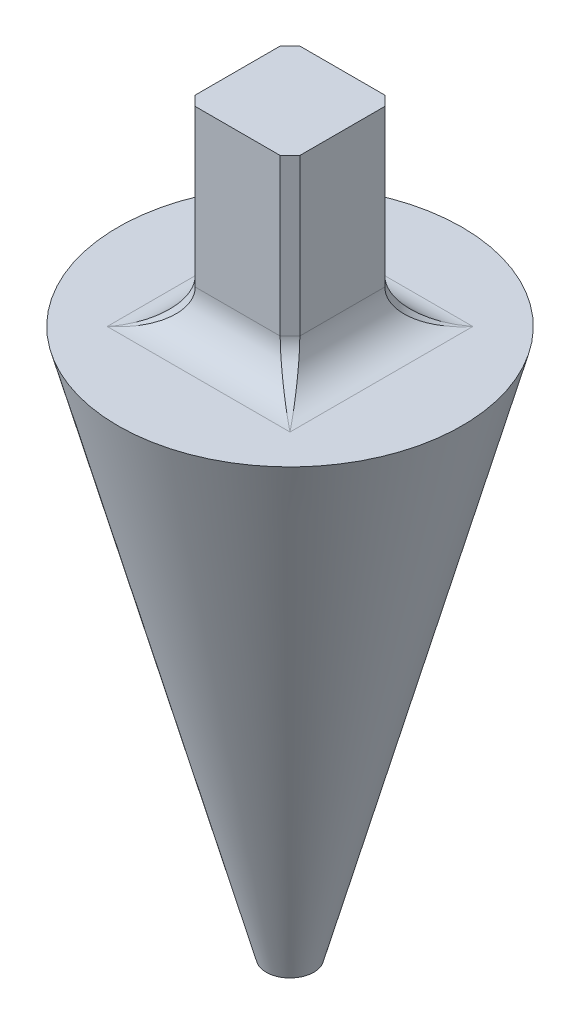
ISO-10303-21;
HEADER;
FILE_DESCRIPTION(('STEP AP214'),'2;1');
FILE_NAME('part.step','',(''),(''),'','','');
FILE_SCHEMA(('AUTOMOTIVE_DESIGN { 1 0 10303 214 1 1 1 1 }'));
ENDSEC;
DATA;
#1=APPLICATION_CONTEXT('core data for automotive mechanical design processes');
#2=APPLICATION_PROTOCOL_DEFINITION('international standard','automotive_design',2000,#1);
#3=PRODUCT_CONTEXT('',#1,'mechanical');
#4=PRODUCT('Part','Part','',(#3));
#5=PRODUCT_RELATED_PRODUCT_CATEGORY('part','',(#4));
#6=PRODUCT_DEFINITION_FORMATION('','',#4);
#7=PRODUCT_DEFINITION_CONTEXT('part definition',#1,'design');
#8=PRODUCT_DEFINITION('design','',#6,#7);
#9=PRODUCT_DEFINITION_SHAPE('','',#8);
#10=(LENGTH_UNIT() NAMED_UNIT(*) SI_UNIT(.MILLI.,.METRE.));
#11=(NAMED_UNIT(*) PLANE_ANGLE_UNIT() SI_UNIT($,.RADIAN.));
#12=(NAMED_UNIT(*) SI_UNIT($,.STERADIAN.) SOLID_ANGLE_UNIT());
#13=UNCERTAINTY_MEASURE_WITH_UNIT(LENGTH_MEASURE(1.E-05),#10,'distance_accuracy_value','');
#14=(GEOMETRIC_REPRESENTATION_CONTEXT(3) GLOBAL_UNCERTAINTY_ASSIGNED_CONTEXT((#13)) GLOBAL_UNIT_ASSIGNED_CONTEXT((#10,
#11,#12)) REPRESENTATION_CONTEXT('',''));
#15=CARTESIAN_POINT('',(0.,0.,0.));
#16=DIRECTION('',(0.,0.,1.));
#17=DIRECTION('',(1.,0.,0.));
#18=AXIS2_PLACEMENT_3D('',#15,#16,#17);
#19=CARTESIAN_POINT('',(0.,0.,-11.176));
#20=DIRECTION('',(0.,-1.,0.));
#21=DIRECTION('',(0.,0.,-1.));
#22=AXIS2_PLACEMENT_3D('',#19,#20,#21);
#23=PLANE('',#22);
#24=DIRECTION('',(-1.,0.,0.));
#25=VECTOR('',#24,1.);
#26=CARTESIAN_POINT('',(3.39725,0.,-5.93725));
#27=LINE('',#26,#25);
#28=CARTESIAN_POINT('',(-5.93725,0.,-5.93725));
#29=VERTEX_POINT('',#28);
#30=CARTESIAN_POINT('',(5.93725,0.,-5.93725));
#31=VERTEX_POINT('',#30);
#32=EDGE_CURVE('E151',#29,#31,#27,.F.);
#33=ORIENTED_EDGE('',*,*,#32,.T.);
#34=DIRECTION('',(0.,0.,-1.));
#35=VECTOR('',#34,1.);
#36=CARTESIAN_POINT('',(5.93725,0.,3.39725));
#37=LINE('',#36,#35);
#38=CARTESIAN_POINT('',(5.93725,0.,5.93725));
#39=VERTEX_POINT('',#38);
#40=EDGE_CURVE('E150',#31,#39,#37,.F.);
#41=ORIENTED_EDGE('',*,*,#40,.T.);
#42=DIRECTION('',(1.,0.,0.));
#43=VECTOR('',#42,1.);
#44=CARTESIAN_POINT('',(-3.39725,0.,5.93725));
#45=LINE('',#44,#43);
#46=CARTESIAN_POINT('',(-5.93725,0.,5.93725));
#47=VERTEX_POINT('',#46);
#48=EDGE_CURVE('E137',#39,#47,#45,.F.);
#49=ORIENTED_EDGE('',*,*,#48,.T.);
#50=DIRECTION('',(0.,0.,1.));
#51=VECTOR('',#50,1.);
#52=CARTESIAN_POINT('',(-5.93725,0.,-3.39725));
#53=LINE('',#52,#51);
#54=EDGE_CURVE('E147',#47,#29,#53,.F.);
#55=ORIENTED_EDGE('',*,*,#54,.T.);
#56=EDGE_LOOP('',(#33,#41,#49,#55));
#57=FACE_BOUND('',#56,.T.);
#58=CARTESIAN_POINT('',(0.,0.,0.));
#59=DIRECTION('',(0.,1.,0.));
#60=DIRECTION('',(0.,0.,1.));
#61=AXIS2_PLACEMENT_3D('',#58,#59,#60);
#62=CIRCLE('',#61,11.176);
#63=CARTESIAN_POINT('',(0.,0.,11.176));
#64=VERTEX_POINT('',#63);
#65=EDGE_CURVE('E159',#64,#64,#62,.T.);
#66=ORIENTED_EDGE('',*,*,#65,.T.);
#67=EDGE_LOOP('',(#66));
#68=FACE_BOUND('',#67,.T.);
#69=ADVANCED_FACE('F36',(#57,#68),#23,.F.);
#70=CARTESIAN_POINT('',(0.,-41.275,0.));
#71=DIRECTION('',(0.,1.,0.));
#72=DIRECTION('',(0.,0.,1.));
#73=AXIS2_PLACEMENT_3D('',#70,#71,#72);
#74=CONICAL_SURFACE('',#73,0.,0.264428659663494);
#75=CARTESIAN_POINT('',(0.,-35.56,0.));
#76=DIRECTION('',(0.,1.,0.));
#77=DIRECTION('',(0.,0.,1.));
#78=AXIS2_PLACEMENT_3D('',#75,#76,#77);
#79=CIRCLE('',#78,1.54744615384616);
#80=CARTESIAN_POINT('',(0.,-35.56,1.54744615384615));
#81=VERTEX_POINT('',#80);
#82=EDGE_CURVE('E429',#81,#81,#79,.T.);
#83=CARTESIAN_POINT('',(0.,-35.56,1.54744615384615));
#84=CARTESIAN_POINT('',(0.,-35.1895833333333,1.64774358974359));
#85=CARTESIAN_POINT('',(0.,-34.8191666666667,1.74804102564102));
#86=CARTESIAN_POINT('',(0.,-34.0783333333333,1.94863589743589));
#87=CARTESIAN_POINT('',(0.,-33.7079166666667,2.04893333333333));
#88=CARTESIAN_POINT('',(0.,-32.9670833333333,2.2495282051282));
#89=CARTESIAN_POINT('',(0.,-32.5966666666667,2.34982564102564));
#90=CARTESIAN_POINT('',(0.,-31.8558333333333,2.55042051282051));
#91=CARTESIAN_POINT('',(0.,-31.4854166666667,2.65071794871794));
#92=CARTESIAN_POINT('',(0.,-30.7445833333333,2.85131282051282));
#93=CARTESIAN_POINT('',(0.,-30.3741666666667,2.95161025641025));
#94=CARTESIAN_POINT('',(0.,-29.6333333333333,3.15220512820512));
#95=CARTESIAN_POINT('',(0.,-29.2629166666667,3.25250256410256));
#96=CARTESIAN_POINT('',(0.,-28.5220833333333,3.45309743589743));
#97=CARTESIAN_POINT('',(0.,-28.1516666666667,3.55339487179487));
#98=CARTESIAN_POINT('',(0.,-27.4108333333333,3.75398974358974));
#99=CARTESIAN_POINT('',(0.,-27.0404166666667,3.85428717948718));
#100=CARTESIAN_POINT('',(0.,-26.2995833333333,4.05488205128205));
#101=CARTESIAN_POINT('',(0.,-25.9291666666667,4.15517948717948));
#102=CARTESIAN_POINT('',(0.,-25.1883333333333,4.35577435897436));
#103=CARTESIAN_POINT('',(0.,-24.8179166666667,4.45607179487179));
#104=CARTESIAN_POINT('',(0.,-24.0770833333333,4.65666666666666));
#105=CARTESIAN_POINT('',(0.,-23.7066666666667,4.7569641025641));
#106=CARTESIAN_POINT('',(0.,-22.9658333333333,4.95755897435897));
#107=CARTESIAN_POINT('',(0.,-22.5954166666667,5.05785641025641));
#108=CARTESIAN_POINT('',(0.,-21.8545833333333,5.25845128205128));
#109=CARTESIAN_POINT('',(0.,-21.4841666666667,5.35874871794871));
#110=CARTESIAN_POINT('',(0.,-20.7433333333333,5.55934358974359));
#111=CARTESIAN_POINT('',(0.,-20.3729166666667,5.65964102564102));
#112=CARTESIAN_POINT('',(0.,-19.6320833333333,5.86023589743589));
#113=CARTESIAN_POINT('',(0.,-19.2616666666667,5.96053333333333));
#114=CARTESIAN_POINT('',(0.,-18.5208333333333,6.1611282051282));
#115=CARTESIAN_POINT('',(0.,-18.1504166666667,6.26142564102564));
#116=CARTESIAN_POINT('',(0.,-17.4095833333333,6.46202051282051));
#117=CARTESIAN_POINT('',(0.,-17.0391666666667,6.56231794871795));
#118=CARTESIAN_POINT('',(0.,-16.2983333333333,6.76291282051282));
#119=CARTESIAN_POINT('',(0.,-15.9279166666667,6.86321025641025));
#120=CARTESIAN_POINT('',(0.,-15.1870833333333,7.06380512820513));
#121=CARTESIAN_POINT('',(0.,-14.8166666666667,7.16410256410256));
#122=CARTESIAN_POINT('',(0.,-14.0758333333333,7.36469743589743));
#123=CARTESIAN_POINT('',(0.,-13.7054166666667,7.46499487179487));
#124=CARTESIAN_POINT('',(0.,-12.9645833333333,7.66558974358974));
#125=CARTESIAN_POINT('',(0.,-12.5941666666667,7.76588717948718));
#126=CARTESIAN_POINT('',(0.,-11.8533333333333,7.96648205128205));
#127=CARTESIAN_POINT('',(0.,-11.4829166666667,8.06677948717949));
#128=CARTESIAN_POINT('',(0.,-10.7420833333333,8.26737435897436));
#129=CARTESIAN_POINT('',(0.,-10.3716666666667,8.36767179487179));
#130=CARTESIAN_POINT('',(0.,-9.63083333333334,8.56826666666666));
#131=CARTESIAN_POINT('',(0.,-9.26041666666667,8.6685641025641));
#132=CARTESIAN_POINT('',(0.,-8.51958333333334,8.86915897435897));
#133=CARTESIAN_POINT('',(0.,-8.14916666666667,8.96945641025641));
#134=CARTESIAN_POINT('',(0.,-7.40833333333333,9.17005128205128));
#135=CARTESIAN_POINT('',(0.,-7.03791666666667,9.27034871794872));
#136=CARTESIAN_POINT('',(0.,-6.29708333333333,9.47094358974359));
#137=CARTESIAN_POINT('',(0.,-5.92666666666667,9.57124102564102));
#138=CARTESIAN_POINT('',(0.,-5.18583333333334,9.7718358974359));
#139=CARTESIAN_POINT('',(0.,-4.81541666666667,9.87213333333333));
#140=CARTESIAN_POINT('',(0.,-4.07458333333333,10.0727282051282));
#141=CARTESIAN_POINT('',(0.,-3.70416666666667,10.1730256410256));
#142=CARTESIAN_POINT('',(0.,-2.96333333333334,10.3736205128205));
#143=CARTESIAN_POINT('',(0.,-2.59291666666667,10.4739179487179));
#144=CARTESIAN_POINT('',(0.,-1.85208333333334,10.6745128205128));
#145=CARTESIAN_POINT('',(0.,-1.48166666666667,10.7748102564103));
#146=CARTESIAN_POINT('',(0.,-0.740833333333336,10.9754051282051));
#147=CARTESIAN_POINT('',(0.,-0.370416666666671,11.0757025641026));
#148=CARTESIAN_POINT('',(0.,0.,11.176));
#149=B_SPLINE_CURVE_WITH_KNOTS('',3,(#83,#84,#85,#86,#87,#88,#89,#90,#91,#92,#93,#94,#95,#96,
#97,#98,#99,#100,#101,#102,#103,#104,#105,#106,#107,#108,#109,#110,#111,#112,#113,#114,#115,
#116,#117,#118,#119,#120,#121,#122,#123,#124,#125,#126,#127,#128,#129,#130,#131,#132,#133,#134,
#135,#136,#137,#138,#139,#140,#141,#142,#143,#144,#145,#146,#147,#148),.UNSPECIFIED.,.F.,.F.,(4,
2,2,2,2,2,2,2,2,2,2,2,2,2,2,2,2,2,2,2,2,2,2,2,2,2,2,2,2,2,2,2,4),(0.,1.15126571360759,
2.30253142721518,3.45379714082278,4.60506285443037,5.75632856803796,6.90759428164556,
8.05885999525315,9.21012570886075,10.3613914224683,11.5126571360759,12.6639228496835,
13.8151885632911,14.9664542768987,16.1177199905063,17.2689857041139,18.4202514177215,
19.5715171313291,20.7227828449367,21.8740485585443,23.0253142721519,24.1765799857595,
25.3278456993671,26.4791114129747,27.6303771265822,28.7816428401898,29.9329085537974,
31.084174267405,32.2354399810126,33.3867056946202,34.5379714082278,35.6892371218354,
36.840502835443),.UNSPECIFIED.);
#150=EDGE_CURVE('BSEAM556',#81,#64,#149,.T.);
#151=ORIENTED_EDGE('',*,*,#82,.T.);
#152=ORIENTED_EDGE('',*,*,#65,.F.);
#153=ORIENTED_EDGE('',*,*,#150,.T.);
#154=ORIENTED_EDGE('',*,*,#150,.F.);
#155=EDGE_LOOP('',(#151,#153,#152,#154));
#156=FACE_BOUND('',#155,.T.);
#157=ADVANCED_FACE('F556',(#156),#74,.T.);
#158=CARTESIAN_POINT('',(3.39725,12.7,-3.39725));
#159=DIRECTION('',(-1.,0.,0.));
#160=DIRECTION('',(0.,0.,1.));
#161=AXIS2_PLACEMENT_3D('',#158,#159,#160);
#162=PLANE('',#161);
#163=DIRECTION('',(0.,0.,-1.));
#164=VECTOR('',#163,1.);
#165=CARTESIAN_POINT('',(3.39725,2.54,-3.39725));
#166=LINE('',#165,#164);
#167=CARTESIAN_POINT('',(3.39725,2.54,2.76225));
#168=VERTEX_POINT('',#167);
#169=CARTESIAN_POINT('',(3.39725,2.54,-2.76225));
#170=VERTEX_POINT('',#169);
#171=EDGE_CURVE('E156',#168,#170,#166,.T.);
#172=ORIENTED_EDGE('',*,*,#171,.T.);
#173=DIRECTION('',(0.,1.,0.));
#174=VECTOR('',#173,1.);
#175=CARTESIAN_POINT('',(3.39725,12.7,-2.76225));
#176=LINE('',#175,#174);
#177=CARTESIAN_POINT('',(3.39725,12.7,-2.76225));
#178=VERTEX_POINT('',#177);
#179=EDGE_CURVE('E492',#170,#178,#176,.T.);
#180=ORIENTED_EDGE('',*,*,#179,.T.);
#181=DIRECTION('',(0.,0.,-1.));
#182=VECTOR('',#181,1.);
#183=CARTESIAN_POINT('',(3.39725,12.7,-3.39725));
#184=LINE('',#183,#182);
#185=CARTESIAN_POINT('',(3.39725,12.7,2.76225));
#186=VERTEX_POINT('',#185);
#187=EDGE_CURVE('E431',#186,#178,#184,.T.);
#188=ORIENTED_EDGE('',*,*,#187,.F.);
#189=DIRECTION('',(0.,-1.,0.));
#190=VECTOR('',#189,1.);
#191=CARTESIAN_POINT('',(3.39725,12.7,2.76225));
#192=LINE('',#191,#190);
#193=EDGE_CURVE('E490',#186,#168,#192,.T.);
#194=ORIENTED_EDGE('',*,*,#193,.T.);
#195=EDGE_LOOP('',(#172,#180,#188,#194));
#196=FACE_BOUND('',#195,.T.);
#197=ADVANCED_FACE('F542',(#196),#162,.F.);
#198=CARTESIAN_POINT('',(-3.39725,12.7,-3.39725));
#199=DIRECTION('',(0.,0.,1.));
#200=DIRECTION('',(1.,0.,0.));
#201=AXIS2_PLACEMENT_3D('',#198,#199,#200);
#202=PLANE('',#201);
#203=DIRECTION('',(-1.,0.,0.));
#204=VECTOR('',#203,1.);
#205=CARTESIAN_POINT('',(-3.39725,12.7,-3.39725));
#206=LINE('',#205,#204);
#207=CARTESIAN_POINT('',(2.76225,12.7,-3.39725));
#208=VERTEX_POINT('',#207);
#209=CARTESIAN_POINT('',(-2.76225,12.7,-3.39725));
#210=VERTEX_POINT('',#209);
#211=EDGE_CURVE('E436',#208,#210,#206,.T.);
#212=ORIENTED_EDGE('',*,*,#211,.F.);
#213=DIRECTION('',(0.,-1.,0.));
#214=VECTOR('',#213,1.);
#215=CARTESIAN_POINT('',(2.76225,12.7,-3.39725));
#216=LINE('',#215,#214);
#217=CARTESIAN_POINT('',(2.76225,2.54,-3.39725));
#218=VERTEX_POINT('',#217);
#219=EDGE_CURVE('E487',#208,#218,#216,.T.);
#220=ORIENTED_EDGE('',*,*,#219,.T.);
#221=DIRECTION('',(-1.,0.,0.));
#222=VECTOR('',#221,1.);
#223=CARTESIAN_POINT('',(-3.39725,2.54,-3.39725));
#224=LINE('',#223,#222);
#225=CARTESIAN_POINT('',(-2.76225,2.54,-3.39725));
#226=VERTEX_POINT('',#225);
#227=EDGE_CURVE('E462',#218,#226,#224,.T.);
#228=ORIENTED_EDGE('',*,*,#227,.T.);
#229=DIRECTION('',(0.,1.,0.));
#230=VECTOR('',#229,1.);
#231=CARTESIAN_POINT('',(-2.76225,12.7,-3.39725));
#232=LINE('',#231,#230);
#233=EDGE_CURVE('E177',#226,#210,#232,.T.);
#234=ORIENTED_EDGE('',*,*,#233,.T.);
#235=EDGE_LOOP('',(#212,#220,#228,#234));
#236=FACE_BOUND('',#235,.T.);
#237=ADVANCED_FACE('F484',(#236),#202,.F.);
#238=CARTESIAN_POINT('',(-3.39725,12.7,-3.39725));
#239=DIRECTION('',(1.,0.,0.));
#240=DIRECTION('',(0.,0.,-1.));
#241=AXIS2_PLACEMENT_3D('',#238,#239,#240);
#242=PLANE('',#241);
#243=DIRECTION('',(0.,0.,1.));
#244=VECTOR('',#243,1.);
#245=CARTESIAN_POINT('',(-3.39725,12.7,-3.39725));
#246=LINE('',#245,#244);
#247=CARTESIAN_POINT('',(-3.39725,12.7,-2.76225));
#248=VERTEX_POINT('',#247);
#249=CARTESIAN_POINT('',(-3.39725,12.7,2.76225));
#250=VERTEX_POINT('',#249);
#251=EDGE_CURVE('E546',#248,#250,#246,.T.);
#252=ORIENTED_EDGE('',*,*,#251,.F.);
#253=DIRECTION('',(0.,-1.,0.));
#254=VECTOR('',#253,1.);
#255=CARTESIAN_POINT('',(-3.39725,12.7,-2.76225));
#256=LINE('',#255,#254);
#257=CARTESIAN_POINT('',(-3.39725,2.54,-2.76225));
#258=VERTEX_POINT('',#257);
#259=EDGE_CURVE('E140',#248,#258,#256,.T.);
#260=ORIENTED_EDGE('',*,*,#259,.T.);
#261=DIRECTION('',(0.,0.,1.));
#262=VECTOR('',#261,1.);
#263=CARTESIAN_POINT('',(-3.39725,2.54,3.39725));
#264=LINE('',#263,#262);
#265=CARTESIAN_POINT('',(-3.39725,2.54,2.76225));
#266=VERTEX_POINT('',#265);
#267=EDGE_CURVE('E510',#258,#266,#264,.T.);
#268=ORIENTED_EDGE('',*,*,#267,.T.);
#269=DIRECTION('',(0.,1.,0.));
#270=VECTOR('',#269,1.);
#271=CARTESIAN_POINT('',(-3.39725,12.7,2.76225));
#272=LINE('',#271,#270);
#273=EDGE_CURVE('E428',#266,#250,#272,.T.);
#274=ORIENTED_EDGE('',*,*,#273,.T.);
#275=EDGE_LOOP('',(#252,#260,#268,#274));
#276=FACE_BOUND('',#275,.T.);
#277=ADVANCED_FACE('F551',(#276),#242,.F.);
#278=CARTESIAN_POINT('',(-3.39725,12.7,3.39725));
#279=DIRECTION('',(0.,0.,-1.));
#280=DIRECTION('',(-1.,0.,0.));
#281=AXIS2_PLACEMENT_3D('',#278,#279,#280);
#282=PLANE('',#281);
#283=DIRECTION('',(1.,0.,0.));
#284=VECTOR('',#283,1.);
#285=CARTESIAN_POINT('',(3.39725,2.54,3.39725));
#286=LINE('',#285,#284);
#287=CARTESIAN_POINT('',(-2.76225,2.54,3.39725));
#288=VERTEX_POINT('',#287);
#289=CARTESIAN_POINT('',(2.76225,2.54,3.39725));
#290=VERTEX_POINT('',#289);
#291=EDGE_CURVE('E139',#288,#290,#286,.T.);
#292=ORIENTED_EDGE('',*,*,#291,.T.);
#293=DIRECTION('',(0.,1.,0.));
#294=VECTOR('',#293,1.);
#295=CARTESIAN_POINT('',(2.76225,12.7,3.39725));
#296=LINE('',#295,#294);
#297=CARTESIAN_POINT('',(2.76225,12.7,3.39725));
#298=VERTEX_POINT('',#297);
#299=EDGE_CURVE('E11',#290,#298,#296,.T.);
#300=ORIENTED_EDGE('',*,*,#299,.T.);
#301=DIRECTION('',(1.,0.,0.));
#302=VECTOR('',#301,1.);
#303=CARTESIAN_POINT('',(-3.39725,12.7,3.39725));
#304=LINE('',#303,#302);
#305=CARTESIAN_POINT('',(-2.76225,12.7,3.39725));
#306=VERTEX_POINT('',#305);
#307=EDGE_CURVE('E540',#306,#298,#304,.T.);
#308=ORIENTED_EDGE('',*,*,#307,.F.);
#309=DIRECTION('',(0.,-1.,0.));
#310=VECTOR('',#309,1.);
#311=CARTESIAN_POINT('',(-2.76225,12.7,3.39725));
#312=LINE('',#311,#310);
#313=EDGE_CURVE('E48',#306,#288,#312,.T.);
#314=ORIENTED_EDGE('',*,*,#313,.T.);
#315=EDGE_LOOP('',(#292,#300,#308,#314));
#316=FACE_BOUND('',#315,.T.);
#317=ADVANCED_FACE('F534',(#316),#282,.F.);
#318=CARTESIAN_POINT('',(0.,12.7,0.));
#319=DIRECTION('',(0.,1.,0.));
#320=DIRECTION('',(0.,0.,1.));
#321=AXIS2_PLACEMENT_3D('',#318,#319,#320);
#322=PLANE('',#321);
#323=ORIENTED_EDGE('',*,*,#187,.T.);
#324=DIRECTION('',(0.707106781186544,0.,0.707106781186551));
#325=VECTOR('',#324,1.);
#326=CARTESIAN_POINT('',(3.07975000000002,12.7,-3.07974999999998));
#327=LINE('',#326,#325);
#328=EDGE_CURVE('E132',#178,#208,#327,.F.);
#329=ORIENTED_EDGE('',*,*,#328,.T.);
#330=ORIENTED_EDGE('',*,*,#211,.T.);
#331=DIRECTION('',(0.707106781186548,0.,-0.707106781186548));
#332=VECTOR('',#331,1.);
#333=CARTESIAN_POINT('',(-3.07975,12.7,-3.07975));
#334=LINE('',#333,#332);
#335=EDGE_CURVE('E507',#210,#248,#334,.F.);
#336=ORIENTED_EDGE('',*,*,#335,.T.);
#337=ORIENTED_EDGE('',*,*,#251,.T.);
#338=DIRECTION('',(-0.707106781186548,0.,-0.707106781186548));
#339=VECTOR('',#338,1.);
#340=CARTESIAN_POINT('',(-3.07975,12.7,3.07975));
#341=LINE('',#340,#339);
#342=EDGE_CURVE('E501',#250,#306,#341,.F.);
#343=ORIENTED_EDGE('',*,*,#342,.T.);
#344=ORIENTED_EDGE('',*,*,#307,.T.);
#345=DIRECTION('',(-0.707106781186547,0.,0.707106781186548));
#346=VECTOR('',#345,1.);
#347=CARTESIAN_POINT('',(3.07975,12.7,3.07975));
#348=LINE('',#347,#346);
#349=EDGE_CURVE('E505',#298,#186,#348,.F.);
#350=ORIENTED_EDGE('',*,*,#349,.T.);
#351=EDGE_LOOP('',(#323,#329,#330,#336,#337,#343,#344,#350));
#352=FACE_BOUND('',#351,.T.);
#353=ADVANCED_FACE('F539',(#352),#322,.T.);
#354=CARTESIAN_POINT('',(0.,-35.56,0.));
#355=DIRECTION('',(0.,1.,0.));
#356=DIRECTION('',(0.,0.,1.));
#357=AXIS2_PLACEMENT_3D('',#354,#355,#356);
#358=PLANE('',#357);
#359=ORIENTED_EDGE('',*,*,#82,.F.);
#360=EDGE_LOOP('',(#359));
#361=FACE_BOUND('',#360,.T.);
#362=ADVANCED_FACE('F574',(#361),#358,.F.);
#363=CARTESIAN_POINT('',(-5.93725,2.54,-3.39725));
#364=DIRECTION('',(0.,0.,-1.));
#365=DIRECTION('',(0.,1.,0.));
#366=AXIS2_PLACEMENT_3D('',#363,#364,#365);
#367=CYLINDRICAL_SURFACE('',#366,2.54);
#368=ORIENTED_EDGE('',*,*,#267,.F.);
#369=CARTESIAN_POINT('',(-5.93725,0.,-5.93725));
#370=CARTESIAN_POINT('',(-5.77100645958709,-1.12002942960682E-05,-5.72944557448386));
#371=CARTESIAN_POINT('',(-5.60476979962949,0.0163728819134338,-5.52164974953686));
#372=CARTESIAN_POINT('',(-5.27867136452858,0.0812378936381565,-5.11402670566073));
#373=CARTESIAN_POINT('',(-5.11882308635639,0.129727338699658,-4.91421635794548));
#374=CARTESIAN_POINT('',(-4.81164507722896,0.256964636143005,-4.5302438465362));
#375=CARTESIAN_POINT('',(-4.66432806041091,0.335707222142205,-4.34609757551363));
#376=CARTESIAN_POINT('',(-4.38787515584951,0.520427147360865,-4.0005314448119));
#377=CARTESIAN_POINT('',(-4.25875071075607,0.626396840816273,-3.83912588844508));
#378=CARTESIAN_POINT('',(-4.02364684081627,0.861500710756064,-3.54524605102034));
#379=CARTESIAN_POINT('',(-3.91767714748121,0.990625155669409,-3.41278393435151));
#380=CARTESIAN_POINT('',(-3.73295722202186,1.26707806059101,-3.18188402752732));
#381=CARTESIAN_POINT('',(-3.65421463632009,1.41439507680143,-3.08345579540011));
#382=CARTESIAN_POINT('',(-3.52697733852257,1.72157308678391,-2.92440917315321));
#383=CARTESIAN_POINT('',(-3.47848789377609,1.88142136383515,-2.86379736722011));
#384=CARTESIAN_POINT('',(-3.4136228817755,2.20751980032292,-2.78271610221937));
#385=CARTESIAN_POINT('',(-3.3972387997057,2.37375645958709,-2.76223599963213));
#386=CARTESIAN_POINT('',(-3.39725,2.54,-2.76225));
#387=B_SPLINE_CURVE_WITH_KNOTS('',3,(#369,#370,#371,#372,#373,#374,#375,#376,#377,#378,#379,
#380,#381,#382,#383,#384,#385,#386),.UNSPECIFIED.,.F.,.F.,(4,2,2,2,2,2,2,2,4),(0.,
0.196349540849362,0.392699081698724,0.589048622548086,0.785398163397448,0.98174770424681,
1.17809724509617,1.37444678594553,1.5707963267949),.UNSPECIFIED.);
#388=EDGE_CURVE('E131',#258,#29,#387,.F.);
#389=ORIENTED_EDGE('',*,*,#388,.T.);
#390=ORIENTED_EDGE('',*,*,#54,.F.);
#391=CARTESIAN_POINT('',(-3.39725,2.54,2.76225));
#392=CARTESIAN_POINT('',(-3.3972387997057,2.37375645958709,2.76223599963213));
#393=CARTESIAN_POINT('',(-3.4136228817755,2.20751980032292,2.78271610221938));
#394=CARTESIAN_POINT('',(-3.47848789377609,1.88142136383515,2.86379736722011));
#395=CARTESIAN_POINT('',(-3.52697733852257,1.72157308678392,2.92440917315321));
#396=CARTESIAN_POINT('',(-3.65421463632009,1.41439507680143,3.08345579540012));
#397=CARTESIAN_POINT('',(-3.73295722202186,1.26707806059101,3.18188402752733));
#398=CARTESIAN_POINT('',(-3.91767714748121,0.990625155669407,3.41278393435151));
#399=CARTESIAN_POINT('',(-4.02364684081627,0.861500710756065,3.54524605102034));
#400=CARTESIAN_POINT('',(-4.25875071075607,0.626396840816269,3.83912588844509));
#401=CARTESIAN_POINT('',(-4.38787515584952,0.520427147360866,4.0005314448119));
#402=CARTESIAN_POINT('',(-4.6643280604109,0.335707222142203,4.34609757551363));
#403=CARTESIAN_POINT('',(-4.81164507722895,0.256964636143005,4.5302438465362));
#404=CARTESIAN_POINT('',(-5.11882308635638,0.129727338699658,4.91421635794548));
#405=CARTESIAN_POINT('',(-5.27867136452858,0.081237893638155,5.11402670566072));
#406=CARTESIAN_POINT('',(-5.60476979962949,0.0163728819134319,5.52164974953686));
#407=CARTESIAN_POINT('',(-5.77100645958708,-1.12002942978607E-05,5.72944557448384));
#408=CARTESIAN_POINT('',(-5.93725,0.,5.93725));
#409=B_SPLINE_CURVE_WITH_KNOTS('',3,(#391,#392,#393,#394,#395,#396,#397,#398,#399,#400,#401,
#402,#403,#404,#405,#406,#407,#408),.UNSPECIFIED.,.F.,.F.,(4,2,2,2,2,2,2,2,4),(3.14159265358979,
3.33794219443916,3.53429173528852,3.73064127613788,3.92699081698724,4.1233403578366,
4.31968989868597,4.51603943953533,4.71238898038469),.UNSPECIFIED.);
#410=EDGE_CURVE('E118',#47,#266,#409,.F.);
#411=ORIENTED_EDGE('',*,*,#410,.T.);
#412=EDGE_LOOP('',(#368,#389,#390,#411));
#413=FACE_BOUND('',#412,.T.);
#414=ADVANCED_FACE('F153',(#413),#367,.F.);
#415=CARTESIAN_POINT('',(-3.39725,2.54,5.93725));
#416=DIRECTION('',(-1.,0.,0.));
#417=DIRECTION('',(0.,0.,1.));
#418=AXIS2_PLACEMENT_3D('',#415,#416,#417);
#419=CYLINDRICAL_SURFACE('',#418,2.54);
#420=ORIENTED_EDGE('',*,*,#48,.F.);
#421=CARTESIAN_POINT('',(2.76225,2.54,3.39725));
#422=CARTESIAN_POINT('',(2.76223599963213,2.37375645958709,3.3972387997057));
#423=CARTESIAN_POINT('',(2.78271610221938,2.20751980032292,3.4136228817755));
#424=CARTESIAN_POINT('',(2.86379736722011,1.88142136383515,3.47848789377609));
#425=CARTESIAN_POINT('',(2.92440917315321,1.72157308678392,3.52697733852257));
#426=CARTESIAN_POINT('',(3.08345579540012,1.41439507680143,3.65421463632009));
#427=CARTESIAN_POINT('',(3.18188402752733,1.26707806059101,3.73295722202186));
#428=CARTESIAN_POINT('',(3.41278393435152,0.990625155669408,3.91767714748121));
#429=CARTESIAN_POINT('',(3.54524605102034,0.861500710756065,4.02364684081627));
#430=CARTESIAN_POINT('',(3.83912588844509,0.626396840816271,4.25875071075607));
#431=CARTESIAN_POINT('',(4.0005314448119,0.520427147360868,4.38787515584951));
#432=CARTESIAN_POINT('',(4.34609757551363,0.335707222142204,4.6643280604109));
#433=CARTESIAN_POINT('',(4.53024384653619,0.256964636143006,4.81164507722895));
#434=CARTESIAN_POINT('',(4.91421635794548,0.129727338699659,5.11882308635638));
#435=CARTESIAN_POINT('',(5.11402670566072,0.0812378936381561,5.27867136452857));
#436=CARTESIAN_POINT('',(5.52164974953686,0.0163728819134316,5.60476979962949));
#437=CARTESIAN_POINT('',(5.72944557448384,-1.12002942972523E-05,5.77100645958707));
#438=CARTESIAN_POINT('',(5.93725000000001,0.,5.93725));
#439=B_SPLINE_CURVE_WITH_KNOTS('',3,(#421,#422,#423,#424,#425,#426,#427,#428,#429,#430,#431,
#432,#433,#434,#435,#436,#437,#438),.UNSPECIFIED.,.F.,.F.,(4,2,2,2,2,2,2,2,4),(3.14159265358979,
3.33794219443916,3.53429173528852,3.73064127613788,3.92699081698724,4.1233403578366,
4.31968989868597,4.51603943953533,4.71238898038469),.UNSPECIFIED.);
#440=EDGE_CURVE('E56',#39,#290,#439,.F.);
#441=ORIENTED_EDGE('',*,*,#440,.T.);
#442=ORIENTED_EDGE('',*,*,#291,.F.);
#443=CARTESIAN_POINT('',(-5.93725000000001,0.,5.93725));
#444=CARTESIAN_POINT('',(-5.72944557448384,-1.12002942976456E-05,5.77100645958707));
#445=CARTESIAN_POINT('',(-5.52164974953686,0.0163728819134316,5.60476979962949));
#446=CARTESIAN_POINT('',(-5.11402670566072,0.0812378936381553,5.27867136452857));
#447=CARTESIAN_POINT('',(-4.91421635794548,0.129727338699658,5.11882308635638));
#448=CARTESIAN_POINT('',(-4.53024384653619,0.256964636143006,4.81164507722895));
#449=CARTESIAN_POINT('',(-4.34609757551363,0.335707222142203,4.6643280604109));
#450=CARTESIAN_POINT('',(-4.0005314448119,0.520427147360868,4.38787515584951));
#451=CARTESIAN_POINT('',(-3.83912588844509,0.62639684081627,4.25875071075607));
#452=CARTESIAN_POINT('',(-3.54524605102034,0.861500710756065,4.02364684081627));
#453=CARTESIAN_POINT('',(-3.41278393435152,0.990625155669408,3.91767714748121));
#454=CARTESIAN_POINT('',(-3.18188402752733,1.26707806059101,3.73295722202186));
#455=CARTESIAN_POINT('',(-3.08345579540012,1.41439507680143,3.65421463632009));
#456=CARTESIAN_POINT('',(-2.92440917315321,1.72157308678392,3.52697733852257));
#457=CARTESIAN_POINT('',(-2.86379736722011,1.88142136383515,3.47848789377609));
#458=CARTESIAN_POINT('',(-2.78271610221938,2.20751980032292,3.4136228817755));
#459=CARTESIAN_POINT('',(-2.76223599963213,2.37375645958709,3.3972387997057));
#460=CARTESIAN_POINT('',(-2.76225,2.54,3.39725));
#461=B_SPLINE_CURVE_WITH_KNOTS('',3,(#443,#444,#445,#446,#447,#448,#449,#450,#451,#452,#453,
#454,#455,#456,#457,#458,#459,#460),.UNSPECIFIED.,.F.,.F.,(4,2,2,2,2,2,2,2,4),(3.14159265358979,
3.33794219443916,3.53429173528852,3.73064127613788,3.92699081698724,4.1233403578366,
4.31968989868597,4.51603943953533,4.71238898038469),.UNSPECIFIED.);
#462=EDGE_CURVE('E121',#288,#47,#461,.F.);
#463=ORIENTED_EDGE('',*,*,#462,.T.);
#464=EDGE_LOOP('',(#420,#441,#442,#463));
#465=FACE_BOUND('',#464,.T.);
#466=ADVANCED_FACE('F136',(#465),#419,.F.);
#467=CARTESIAN_POINT('',(-3.39725,2.54,-5.93725));
#468=DIRECTION('',(1.,0.,0.));
#469=DIRECTION('',(0.,0.,-1.));
#470=AXIS2_PLACEMENT_3D('',#467,#468,#469);
#471=CYLINDRICAL_SURFACE('',#470,2.54);
#472=ORIENTED_EDGE('',*,*,#227,.F.);
#473=CARTESIAN_POINT('',(5.93725,0.,-5.93725));
#474=CARTESIAN_POINT('',(5.72944557448386,-1.12002942921013E-05,-5.77100645958709));
#475=CARTESIAN_POINT('',(5.52164974953686,0.0163728819134374,-5.60476979962949));
#476=CARTESIAN_POINT('',(5.11402670566073,0.0812378936381605,-5.27867136452858));
#477=CARTESIAN_POINT('',(4.91421635794548,0.129727338699662,-5.11882308635639));
#478=CARTESIAN_POINT('',(4.5302438465362,0.256964636143008,-4.81164507722896));
#479=CARTESIAN_POINT('',(4.34609757551363,0.335707222142209,-4.6643280604109));
#480=CARTESIAN_POINT('',(4.0005314448119,0.520427147360867,-4.38787515584952));
#481=CARTESIAN_POINT('',(3.83912588844508,0.626396840816278,-4.25875071075607));
#482=CARTESIAN_POINT('',(3.54524605102034,0.861500710756066,-4.02364684081628));
#483=CARTESIAN_POINT('',(3.41278393435151,0.990625155669413,-3.91767714748121));
#484=CARTESIAN_POINT('',(3.18188402752733,1.26707806059101,-3.73295722202187));
#485=CARTESIAN_POINT('',(3.08345579540011,1.41439507680143,-3.65421463632009));
#486=CARTESIAN_POINT('',(2.92440917315321,1.72157308678391,-3.52697733852258));
#487=CARTESIAN_POINT('',(2.86379736722011,1.88142136383515,-3.47848789377609));
#488=CARTESIAN_POINT('',(2.78271610221938,2.20751980032292,-3.41362288177551));
#489=CARTESIAN_POINT('',(2.76223599963213,2.37375645958709,-3.39723879970571));
#490=CARTESIAN_POINT('',(2.76225,2.54,-3.39725000000001));
#491=B_SPLINE_CURVE_WITH_KNOTS('',3,(#473,#474,#475,#476,#477,#478,#479,#480,#481,#482,#483,
#484,#485,#486,#487,#488,#489,#490),.UNSPECIFIED.,.F.,.F.,(4,2,2,2,2,2,2,2,4),(0.,
0.196349540849362,0.392699081698724,0.589048622548086,0.785398163397448,0.98174770424681,
1.17809724509617,1.37444678594553,1.5707963267949),.UNSPECIFIED.);
#492=EDGE_CURVE('E173',#218,#31,#491,.F.);
#493=ORIENTED_EDGE('',*,*,#492,.T.);
#494=ORIENTED_EDGE('',*,*,#32,.F.);
#495=CARTESIAN_POINT('',(-2.76225,2.54,-3.39725));
#496=CARTESIAN_POINT('',(-2.76223599963213,2.37375645958709,-3.3972387997057));
#497=CARTESIAN_POINT('',(-2.78271610221937,2.20751980032292,-3.4136228817755));
#498=CARTESIAN_POINT('',(-2.86379736722011,1.88142136383515,-3.47848789377609));
#499=CARTESIAN_POINT('',(-2.92440917315321,1.72157308678391,-3.52697733852257));
#500=CARTESIAN_POINT('',(-3.08345579540011,1.41439507680143,-3.65421463632009));
#501=CARTESIAN_POINT('',(-3.18188402752732,1.26707806059101,-3.73295722202186));
#502=CARTESIAN_POINT('',(-3.41278393435151,0.99062515566941,-3.91767714748121));
#503=CARTESIAN_POINT('',(-3.54524605102034,0.861500710756064,-4.02364684081628));
#504=CARTESIAN_POINT('',(-3.83912588844508,0.626396840816275,-4.25875071075607));
#505=CARTESIAN_POINT('',(-4.00053144481189,0.520427147360864,-4.38787515584952));
#506=CARTESIAN_POINT('',(-4.34609757551363,0.335707222142206,-4.6643280604109));
#507=CARTESIAN_POINT('',(-4.5302438465362,0.256964636143005,-4.81164507722896));
#508=CARTESIAN_POINT('',(-4.91421635794548,0.129727338699659,-5.11882308635638));
#509=CARTESIAN_POINT('',(-5.11402670566072,0.0812378936381572,-5.27867136452858));
#510=CARTESIAN_POINT('',(-5.52164974953686,0.0163728819134337,-5.60476979962948));
#511=CARTESIAN_POINT('',(-5.72944557448386,-1.12002942955982E-05,-5.77100645958709));
#512=CARTESIAN_POINT('',(-5.93725,0.,-5.93725));
#513=B_SPLINE_CURVE_WITH_KNOTS('',3,(#495,#496,#497,#498,#499,#500,#501,#502,#503,#504,#505,
#506,#507,#508,#509,#510,#511,#512),.UNSPECIFIED.,.F.,.F.,(4,2,2,2,2,2,2,2,4),(0.,
0.196349540849362,0.392699081698724,0.589048622548086,0.785398163397448,0.98174770424681,
1.17809724509617,1.37444678594553,1.5707963267949),.UNSPECIFIED.);
#514=EDGE_CURVE('E481',#29,#226,#513,.F.);
#515=ORIENTED_EDGE('',*,*,#514,.T.);
#516=EDGE_LOOP('',(#472,#493,#494,#515));
#517=FACE_BOUND('',#516,.T.);
#518=ADVANCED_FACE('F179',(#517),#471,.F.);
#519=CARTESIAN_POINT('',(5.93725,2.54,-3.39725));
#520=DIRECTION('',(0.,0.,1.));
#521=DIRECTION('',(0.,-1.,0.));
#522=AXIS2_PLACEMENT_3D('',#519,#520,#521);
#523=CYLINDRICAL_SURFACE('',#522,2.54);
#524=ORIENTED_EDGE('',*,*,#40,.F.);
#525=CARTESIAN_POINT('',(3.39725,2.54,-2.76225));
#526=CARTESIAN_POINT('',(3.3972387997057,2.37375645958709,-2.76223599963213));
#527=CARTESIAN_POINT('',(3.4136228817755,2.20751980032292,-2.78271610221938));
#528=CARTESIAN_POINT('',(3.47848789377608,1.88142136383515,-2.86379736722011));
#529=CARTESIAN_POINT('',(3.52697733852257,1.72157308678391,-2.92440917315322));
#530=CARTESIAN_POINT('',(3.65421463632009,1.41439507680143,-3.08345579540012));
#531=CARTESIAN_POINT('',(3.73295722202186,1.26707806059101,-3.18188402752733));
#532=CARTESIAN_POINT('',(3.91767714748121,0.990625155669409,-3.41278393435151));
#533=CARTESIAN_POINT('',(4.02364684081627,0.861500710756061,-3.54524605102034));
#534=CARTESIAN_POINT('',(4.25875071075606,0.626396840816272,-3.83912588844508));
#535=CARTESIAN_POINT('',(4.38787515584951,0.520427147360863,-4.0005314448119));
#536=CARTESIAN_POINT('',(4.6643280604109,0.335707222142201,-4.34609757551363));
#537=CARTESIAN_POINT('',(4.81164507722896,0.256964636143001,-4.5302438465362));
#538=CARTESIAN_POINT('',(5.11882308635638,0.129727338699656,-4.91421635794548));
#539=CARTESIAN_POINT('',(5.27867136452858,0.0812378936381532,-5.11402670566073));
#540=CARTESIAN_POINT('',(5.60476979962948,0.0163728819134311,-5.52164974953686));
#541=CARTESIAN_POINT('',(5.77100645958708,-1.12002942990398E-05,-5.72944557448386));
#542=CARTESIAN_POINT('',(5.93725,0.,-5.93725));
#543=B_SPLINE_CURVE_WITH_KNOTS('',3,(#525,#526,#527,#528,#529,#530,#531,#532,#533,#534,#535,
#536,#537,#538,#539,#540,#541,#542),.UNSPECIFIED.,.F.,.F.,(4,2,2,2,2,2,2,2,4),(0.,
0.196349540849362,0.392699081698724,0.589048622548086,0.785398163397448,0.98174770424681,
1.17809724509617,1.37444678594553,1.5707963267949),.UNSPECIFIED.);
#544=EDGE_CURVE('E467',#31,#170,#543,.F.);
#545=ORIENTED_EDGE('',*,*,#544,.T.);
#546=ORIENTED_EDGE('',*,*,#171,.F.);
#547=CARTESIAN_POINT('',(5.93725,0.,5.93725));
#548=CARTESIAN_POINT('',(5.77100645958707,-1.12002942970914E-05,5.72944557448384));
#549=CARTESIAN_POINT('',(5.60476979962949,0.0163728819134324,5.52164974953686));
#550=CARTESIAN_POINT('',(5.27867136452857,0.0812378936381557,5.11402670566072));
#551=CARTESIAN_POINT('',(5.11882308635638,0.129727338699659,4.91421635794548));
#552=CARTESIAN_POINT('',(4.81164507722896,0.256964636143005,4.5302438465362));
#553=CARTESIAN_POINT('',(4.6643280604109,0.335707222142204,4.34609757551363));
#554=CARTESIAN_POINT('',(4.38787515584951,0.520427147360866,4.0005314448119));
#555=CARTESIAN_POINT('',(4.25875071075607,0.626396840816269,3.83912588844508));
#556=CARTESIAN_POINT('',(4.02364684081627,0.861500710756064,3.54524605102035));
#557=CARTESIAN_POINT('',(3.91767714748121,0.990625155669409,3.41278393435151));
#558=CARTESIAN_POINT('',(3.73295722202186,1.26707806059101,3.18188402752733));
#559=CARTESIAN_POINT('',(3.65421463632009,1.41439507680143,3.08345579540012));
#560=CARTESIAN_POINT('',(3.52697733852257,1.72157308678391,2.92440917315321));
#561=CARTESIAN_POINT('',(3.47848789377609,1.88142136383515,2.86379736722011));
#562=CARTESIAN_POINT('',(3.4136228817755,2.20751980032292,2.78271610221938));
#563=CARTESIAN_POINT('',(3.3972387997057,2.37375645958709,2.76223599963213));
#564=CARTESIAN_POINT('',(3.39725,2.54,2.76225));
#565=B_SPLINE_CURVE_WITH_KNOTS('',3,(#547,#548,#549,#550,#551,#552,#553,#554,#555,#556,#557,
#558,#559,#560,#561,#562,#563,#564),.UNSPECIFIED.,.F.,.F.,(4,2,2,2,2,2,2,2,4),(3.14159265358979,
3.33794219443916,3.53429173528852,3.73064127613788,3.92699081698724,4.1233403578366,
4.31968989868597,4.51603943953533,4.71238898038469),.UNSPECIFIED.);
#566=EDGE_CURVE('E330',#168,#39,#565,.F.);
#567=ORIENTED_EDGE('',*,*,#566,.T.);
#568=EDGE_LOOP('',(#524,#545,#546,#567));
#569=FACE_BOUND('',#568,.T.);
#570=ADVANCED_FACE('F189',(#569),#523,.F.);
#571=CARTESIAN_POINT('',(2.76225,12.7,-3.39725));
#572=DIRECTION('',(-0.707106781186551,0.,0.707106781186544));
#573=DIRECTION('',(0.,-1.,0.));
#574=AXIS2_PLACEMENT_3D('',#571,#572,#573);
#575=PLANE('',#574);
#576=ORIENTED_EDGE('',*,*,#328,.F.);
#577=ORIENTED_EDGE('',*,*,#179,.F.);
#578=CARTESIAN_POINT('',(2.76225,2.54,-3.39725000000001));
#579=CARTESIAN_POINT('',(3.39725,2.54,-2.76225));
#580=B_SPLINE_CURVE_WITH_KNOTS('',1,(#578,#579),.UNSPECIFIED.,.F.,.F.,(2,2),(0.,1.),.UNSPECIFIED.);
#581=EDGE_CURVE('E219',#218,#170,#580,.T.);
#582=ORIENTED_EDGE('',*,*,#581,.F.);
#583=ORIENTED_EDGE('',*,*,#219,.F.);
#584=EDGE_LOOP('',(#576,#577,#582,#583));
#585=FACE_BOUND('',#584,.T.);
#586=ADVANCED_FACE('F242',(#585),#575,.F.);
#587=CARTESIAN_POINT('',(2.76225,2.54,-3.39725000000001));
#588=CARTESIAN_POINT('',(2.76223599963213,2.37375645958709,-3.39723879970571));
#589=CARTESIAN_POINT('',(2.78271610221938,2.20751980032292,-3.41362288177551));
#590=CARTESIAN_POINT('',(2.86379736722011,1.88142136383515,-3.47848789377609));
#591=CARTESIAN_POINT('',(2.92440917315321,1.72157308678391,-3.52697733852258));
#592=CARTESIAN_POINT('',(3.08345579540011,1.41439507680143,-3.65421463632009));
#593=CARTESIAN_POINT('',(3.18188402752733,1.26707806059101,-3.73295722202187));
#594=CARTESIAN_POINT('',(3.41278393435151,0.990625155669413,-3.91767714748121));
#595=CARTESIAN_POINT('',(3.54524605102034,0.861500710756066,-4.02364684081628));
#596=CARTESIAN_POINT('',(3.83912588844508,0.626396840816278,-4.25875071075607));
#597=CARTESIAN_POINT('',(4.0005314448119,0.520427147360867,-4.38787515584952));
#598=CARTESIAN_POINT('',(4.34609757551363,0.335707222142209,-4.6643280604109));
#599=CARTESIAN_POINT('',(4.5302438465362,0.256964636143008,-4.81164507722896));
#600=CARTESIAN_POINT('',(4.91421635794548,0.129727338699662,-5.11882308635639));
#601=CARTESIAN_POINT('',(5.11402670566073,0.0812378936381605,-5.27867136452858));
#602=CARTESIAN_POINT('',(5.52164974953686,0.0163728819134374,-5.60476979962949));
#603=CARTESIAN_POINT('',(5.72944557448386,-1.12002942921013E-05,-5.77100645958709));
#604=CARTESIAN_POINT('',(5.93725,0.,-5.93725));
#605=CARTESIAN_POINT('',(3.39725,2.54,-2.76225));
#606=CARTESIAN_POINT('',(3.3972387997057,2.37375645958709,-2.76223599963213));
#607=CARTESIAN_POINT('',(3.4136228817755,2.20751980032292,-2.78271610221938));
#608=CARTESIAN_POINT('',(3.47848789377608,1.88142136383515,-2.86379736722011));
#609=CARTESIAN_POINT('',(3.52697733852257,1.72157308678391,-2.92440917315322));
#610=CARTESIAN_POINT('',(3.65421463632009,1.41439507680143,-3.08345579540012));
#611=CARTESIAN_POINT('',(3.73295722202186,1.26707806059101,-3.18188402752733));
#612=CARTESIAN_POINT('',(3.91767714748121,0.990625155669409,-3.41278393435151));
#613=CARTESIAN_POINT('',(4.02364684081627,0.861500710756061,-3.54524605102034));
#614=CARTESIAN_POINT('',(4.25875071075606,0.626396840816272,-3.83912588844508));
#615=CARTESIAN_POINT('',(4.38787515584951,0.520427147360863,-4.0005314448119));
#616=CARTESIAN_POINT('',(4.6643280604109,0.335707222142201,-4.34609757551363));
#617=CARTESIAN_POINT('',(4.81164507722896,0.256964636143001,-4.5302438465362));
#618=CARTESIAN_POINT('',(5.11882308635638,0.129727338699656,-4.91421635794548));
#619=CARTESIAN_POINT('',(5.27867136452858,0.0812378936381532,-5.11402670566073));
#620=CARTESIAN_POINT('',(5.60476979962948,0.0163728819134311,-5.52164974953686));
#621=CARTESIAN_POINT('',(5.77100645958708,-1.12002942990398E-05,-5.72944557448386));
#622=CARTESIAN_POINT('',(5.93725,0.,-5.93725));
#623=B_SPLINE_SURFACE_WITH_KNOTS('',1,3,((#587,#588,#589,#590,#591,#592,#593,#594,#595,#596,
#597,#598,#599,#600,#601,#602,#603,#604),(#605,#606,#607,#608,#609,#610,#611,#612,#613,#614,
#615,#616,#617,#618,#619,#620,#621,#622)),.UNSPECIFIED.,.F.,.F.,.F.,(2,2),(4,2,2,2,2,2,2,2,4),
(0.,1.),(0.,0.196349540849362,0.392699081698724,0.589048622548086,0.785398163397448,
0.98174770424681,1.17809724509617,1.37444678594553,1.5707963267949),.UNSPECIFIED.);
#624=ORIENTED_EDGE('',*,*,#544,.F.);
#625=ORIENTED_EDGE('',*,*,#492,.F.);
#626=ORIENTED_EDGE('',*,*,#581,.T.);
#627=EDGE_LOOP('',(#624,#625,#626));
#628=FACE_BOUND('',#627,.T.);
#629=ADVANCED_FACE('F226',(#628),#623,.T.);
#630=CARTESIAN_POINT('',(-3.39725,12.7,-2.76225));
#631=DIRECTION('',(0.707106781186547,0.,0.707106781186547));
#632=DIRECTION('',(0.,-1.,0.));
#633=AXIS2_PLACEMENT_3D('',#630,#631,#632);
#634=PLANE('',#633);
#635=ORIENTED_EDGE('',*,*,#335,.F.);
#636=ORIENTED_EDGE('',*,*,#233,.F.);
#637=CARTESIAN_POINT('',(-3.39725,2.54,-2.76225));
#638=CARTESIAN_POINT('',(-2.76225,2.54,-3.39725));
#639=B_SPLINE_CURVE_WITH_KNOTS('',1,(#637,#638),.UNSPECIFIED.,.F.,.F.,(2,2),(0.,1.),.UNSPECIFIED.);
#640=EDGE_CURVE('E275',#258,#226,#639,.T.);
#641=ORIENTED_EDGE('',*,*,#640,.F.);
#642=ORIENTED_EDGE('',*,*,#259,.F.);
#643=EDGE_LOOP('',(#635,#636,#641,#642));
#644=FACE_BOUND('',#643,.T.);
#645=ADVANCED_FACE('F241',(#644),#634,.F.);
#646=CARTESIAN_POINT('',(-3.39725,2.54,-2.76225));
#647=CARTESIAN_POINT('',(-3.3972387997057,2.37375645958709,-2.76223599963213));
#648=CARTESIAN_POINT('',(-3.4136228817755,2.20751980032292,-2.78271610221937));
#649=CARTESIAN_POINT('',(-3.47848789377609,1.88142136383515,-2.86379736722011));
#650=CARTESIAN_POINT('',(-3.52697733852257,1.72157308678391,-2.92440917315321));
#651=CARTESIAN_POINT('',(-3.65421463632009,1.41439507680143,-3.08345579540011));
#652=CARTESIAN_POINT('',(-3.73295722202186,1.26707806059101,-3.18188402752732));
#653=CARTESIAN_POINT('',(-3.91767714748121,0.990625155669409,-3.41278393435151));
#654=CARTESIAN_POINT('',(-4.02364684081627,0.861500710756064,-3.54524605102034));
#655=CARTESIAN_POINT('',(-4.25875071075607,0.626396840816273,-3.83912588844508));
#656=CARTESIAN_POINT('',(-4.38787515584951,0.520427147360865,-4.0005314448119));
#657=CARTESIAN_POINT('',(-4.66432806041091,0.335707222142205,-4.34609757551363));
#658=CARTESIAN_POINT('',(-4.81164507722896,0.256964636143005,-4.5302438465362));
#659=CARTESIAN_POINT('',(-5.11882308635639,0.129727338699658,-4.91421635794548));
#660=CARTESIAN_POINT('',(-5.27867136452858,0.0812378936381565,-5.11402670566073));
#661=CARTESIAN_POINT('',(-5.60476979962949,0.0163728819134338,-5.52164974953686));
#662=CARTESIAN_POINT('',(-5.77100645958709,-1.12002942960682E-05,-5.72944557448386));
#663=CARTESIAN_POINT('',(-5.93725,0.,-5.93725));
#664=CARTESIAN_POINT('',(-2.76225,2.54,-3.39725));
#665=CARTESIAN_POINT('',(-2.76223599963213,2.37375645958709,-3.3972387997057));
#666=CARTESIAN_POINT('',(-2.78271610221937,2.20751980032292,-3.4136228817755));
#667=CARTESIAN_POINT('',(-2.86379736722011,1.88142136383515,-3.47848789377609));
#668=CARTESIAN_POINT('',(-2.92440917315321,1.72157308678391,-3.52697733852257));
#669=CARTESIAN_POINT('',(-3.08345579540011,1.41439507680143,-3.65421463632009));
#670=CARTESIAN_POINT('',(-3.18188402752732,1.26707806059101,-3.73295722202186));
#671=CARTESIAN_POINT('',(-3.41278393435151,0.99062515566941,-3.91767714748121));
#672=CARTESIAN_POINT('',(-3.54524605102034,0.861500710756064,-4.02364684081628));
#673=CARTESIAN_POINT('',(-3.83912588844508,0.626396840816275,-4.25875071075607));
#674=CARTESIAN_POINT('',(-4.00053144481189,0.520427147360864,-4.38787515584952));
#675=CARTESIAN_POINT('',(-4.34609757551363,0.335707222142206,-4.6643280604109));
#676=CARTESIAN_POINT('',(-4.5302438465362,0.256964636143005,-4.81164507722896));
#677=CARTESIAN_POINT('',(-4.91421635794548,0.129727338699659,-5.11882308635638));
#678=CARTESIAN_POINT('',(-5.11402670566072,0.0812378936381572,-5.27867136452858));
#679=CARTESIAN_POINT('',(-5.52164974953686,0.0163728819134337,-5.60476979962948));
#680=CARTESIAN_POINT('',(-5.72944557448386,-1.12002942955982E-05,-5.77100645958709));
#681=CARTESIAN_POINT('',(-5.93725,0.,-5.93725));
#682=B_SPLINE_SURFACE_WITH_KNOTS('',1,3,((#646,#647,#648,#649,#650,#651,#652,#653,#654,#655,
#656,#657,#658,#659,#660,#661,#662,#663),(#664,#665,#666,#667,#668,#669,#670,#671,#672,#673,
#674,#675,#676,#677,#678,#679,#680,#681)),.UNSPECIFIED.,.F.,.F.,.F.,(2,2),(4,2,2,2,2,2,2,2,4),
(0.,1.),(0.,0.196349540849362,0.392699081698724,0.589048622548086,0.785398163397448,
0.98174770424681,1.17809724509617,1.37444678594553,1.5707963267949),.UNSPECIFIED.);
#683=ORIENTED_EDGE('',*,*,#514,.F.);
#684=ORIENTED_EDGE('',*,*,#388,.F.);
#685=ORIENTED_EDGE('',*,*,#640,.T.);
#686=EDGE_LOOP('',(#683,#684,#685));
#687=FACE_BOUND('',#686,.T.);
#688=ADVANCED_FACE('F282',(#687),#682,.T.);
#689=CARTESIAN_POINT('',(3.39725,12.7,2.76225));
#690=DIRECTION('',(-0.707106781186548,0.,-0.707106781186547));
#691=DIRECTION('',(0.,-1.,0.));
#692=AXIS2_PLACEMENT_3D('',#689,#690,#691);
#693=PLANE('',#692);
#694=ORIENTED_EDGE('',*,*,#349,.F.);
#695=ORIENTED_EDGE('',*,*,#299,.F.);
#696=CARTESIAN_POINT('',(3.39725,2.54,2.76225));
#697=CARTESIAN_POINT('',(2.76225,2.54,3.39725));
#698=B_SPLINE_CURVE_WITH_KNOTS('',1,(#696,#697),.UNSPECIFIED.,.F.,.F.,(2,2),(0.,1.),.UNSPECIFIED.);
#699=EDGE_CURVE('E371',#168,#290,#698,.T.);
#700=ORIENTED_EDGE('',*,*,#699,.F.);
#701=ORIENTED_EDGE('',*,*,#193,.F.);
#702=EDGE_LOOP('',(#694,#695,#700,#701));
#703=FACE_BOUND('',#702,.T.);
#704=ADVANCED_FACE('F296',(#703),#693,.F.);
#705=CARTESIAN_POINT('',(3.39725,2.54,2.76225));
#706=CARTESIAN_POINT('',(3.3972387997057,2.37375645958709,2.76223599963213));
#707=CARTESIAN_POINT('',(3.4136228817755,2.20751980032292,2.78271610221938));
#708=CARTESIAN_POINT('',(3.47848789377609,1.88142136383515,2.86379736722011));
#709=CARTESIAN_POINT('',(3.52697733852257,1.72157308678391,2.92440917315321));
#710=CARTESIAN_POINT('',(3.65421463632009,1.41439507680143,3.08345579540012));
#711=CARTESIAN_POINT('',(3.73295722202186,1.26707806059101,3.18188402752733));
#712=CARTESIAN_POINT('',(3.91767714748121,0.990625155669409,3.41278393435151));
#713=CARTESIAN_POINT('',(4.02364684081627,0.861500710756064,3.54524605102035));
#714=CARTESIAN_POINT('',(4.25875071075607,0.626396840816269,3.83912588844508));
#715=CARTESIAN_POINT('',(4.38787515584951,0.520427147360866,4.0005314448119));
#716=CARTESIAN_POINT('',(4.6643280604109,0.335707222142204,4.34609757551363));
#717=CARTESIAN_POINT('',(4.81164507722896,0.256964636143005,4.5302438465362));
#718=CARTESIAN_POINT('',(5.11882308635638,0.129727338699659,4.91421635794548));
#719=CARTESIAN_POINT('',(5.27867136452857,0.0812378936381557,5.11402670566072));
#720=CARTESIAN_POINT('',(5.60476979962949,0.0163728819134324,5.52164974953686));
#721=CARTESIAN_POINT('',(5.77100645958707,-1.12002942970914E-05,5.72944557448384));
#722=CARTESIAN_POINT('',(5.93725,0.,5.93725));
#723=CARTESIAN_POINT('',(2.76225,2.54,3.39725));
#724=CARTESIAN_POINT('',(2.76223599963213,2.37375645958709,3.3972387997057));
#725=CARTESIAN_POINT('',(2.78271610221938,2.20751980032292,3.4136228817755));
#726=CARTESIAN_POINT('',(2.86379736722011,1.88142136383515,3.47848789377609));
#727=CARTESIAN_POINT('',(2.92440917315321,1.72157308678392,3.52697733852257));
#728=CARTESIAN_POINT('',(3.08345579540012,1.41439507680143,3.65421463632009));
#729=CARTESIAN_POINT('',(3.18188402752733,1.26707806059101,3.73295722202186));
#730=CARTESIAN_POINT('',(3.41278393435152,0.990625155669408,3.91767714748121));
#731=CARTESIAN_POINT('',(3.54524605102034,0.861500710756065,4.02364684081627));
#732=CARTESIAN_POINT('',(3.83912588844509,0.626396840816271,4.25875071075607));
#733=CARTESIAN_POINT('',(4.0005314448119,0.520427147360868,4.38787515584951));
#734=CARTESIAN_POINT('',(4.34609757551363,0.335707222142204,4.6643280604109));
#735=CARTESIAN_POINT('',(4.53024384653619,0.256964636143006,4.81164507722895));
#736=CARTESIAN_POINT('',(4.91421635794548,0.129727338699659,5.11882308635638));
#737=CARTESIAN_POINT('',(5.11402670566072,0.0812378936381561,5.27867136452857));
#738=CARTESIAN_POINT('',(5.52164974953686,0.0163728819134316,5.60476979962949));
#739=CARTESIAN_POINT('',(5.72944557448384,-1.12002942972523E-05,5.77100645958707));
#740=CARTESIAN_POINT('',(5.93725000000001,0.,5.93725));
#741=B_SPLINE_SURFACE_WITH_KNOTS('',1,3,((#705,#706,#707,#708,#709,#710,#711,#712,#713,#714,
#715,#716,#717,#718,#719,#720,#721,#722),(#723,#724,#725,#726,#727,#728,#729,#730,#731,#732,
#733,#734,#735,#736,#737,#738,#739,#740)),.UNSPECIFIED.,.F.,.F.,.F.,(2,2),(4,2,2,2,2,2,2,2,4),
(0.,1.),(3.14159265358979,3.33794219443916,3.53429173528852,3.73064127613788,3.92699081698724,
4.1233403578366,4.31968989868597,4.51603943953533,4.71238898038469),.UNSPECIFIED.);
#742=ORIENTED_EDGE('',*,*,#699,.T.);
#743=ORIENTED_EDGE('',*,*,#440,.F.);
#744=ORIENTED_EDGE('',*,*,#566,.F.);
#745=EDGE_LOOP('',(#742,#743,#744));
#746=FACE_BOUND('',#745,.T.);
#747=ADVANCED_FACE('F336',(#746),#741,.T.);
#748=CARTESIAN_POINT('',(-2.76225,12.7,3.39725));
#749=DIRECTION('',(0.707106781186548,0.,-0.707106781186548));
#750=DIRECTION('',(0.,-1.,0.));
#751=AXIS2_PLACEMENT_3D('',#748,#749,#750);
#752=PLANE('',#751);
#753=ORIENTED_EDGE('',*,*,#342,.F.);
#754=ORIENTED_EDGE('',*,*,#273,.F.);
#755=CARTESIAN_POINT('',(-2.76225,2.54,3.39725));
#756=CARTESIAN_POINT('',(-3.39725,2.54,2.76225));
#757=B_SPLINE_CURVE_WITH_KNOTS('',1,(#755,#756),.UNSPECIFIED.,.F.,.F.,(2,2),(0.,1.),.UNSPECIFIED.);
#758=EDGE_CURVE('E124',#288,#266,#757,.T.);
#759=ORIENTED_EDGE('',*,*,#758,.F.);
#760=ORIENTED_EDGE('',*,*,#313,.F.);
#761=EDGE_LOOP('',(#753,#754,#759,#760));
#762=FACE_BOUND('',#761,.T.);
#763=ADVANCED_FACE('F39',(#762),#752,.F.);
#764=CARTESIAN_POINT('',(-2.76225,2.54,3.39725));
#765=CARTESIAN_POINT('',(-2.76223599963213,2.37375645958709,3.3972387997057));
#766=CARTESIAN_POINT('',(-2.78271610221938,2.20751980032292,3.4136228817755));
#767=CARTESIAN_POINT('',(-2.86379736722011,1.88142136383515,3.47848789377609));
#768=CARTESIAN_POINT('',(-2.92440917315321,1.72157308678392,3.52697733852257));
#769=CARTESIAN_POINT('',(-3.08345579540012,1.41439507680143,3.65421463632009));
#770=CARTESIAN_POINT('',(-3.18188402752733,1.26707806059101,3.73295722202186));
#771=CARTESIAN_POINT('',(-3.41278393435152,0.990625155669408,3.91767714748121));
#772=CARTESIAN_POINT('',(-3.54524605102034,0.861500710756065,4.02364684081627));
#773=CARTESIAN_POINT('',(-3.83912588844509,0.62639684081627,4.25875071075607));
#774=CARTESIAN_POINT('',(-4.0005314448119,0.520427147360868,4.38787515584951));
#775=CARTESIAN_POINT('',(-4.34609757551363,0.335707222142203,4.6643280604109));
#776=CARTESIAN_POINT('',(-4.53024384653619,0.256964636143006,4.81164507722895));
#777=CARTESIAN_POINT('',(-4.91421635794548,0.129727338699658,5.11882308635638));
#778=CARTESIAN_POINT('',(-5.11402670566072,0.0812378936381553,5.27867136452857));
#779=CARTESIAN_POINT('',(-5.52164974953686,0.0163728819134316,5.60476979962949));
#780=CARTESIAN_POINT('',(-5.72944557448384,-1.12002942976456E-05,5.77100645958707));
#781=CARTESIAN_POINT('',(-5.93725000000001,0.,5.93725));
#782=CARTESIAN_POINT('',(-3.39725,2.54,2.76225));
#783=CARTESIAN_POINT('',(-3.3972387997057,2.37375645958709,2.76223599963213));
#784=CARTESIAN_POINT('',(-3.4136228817755,2.20751980032292,2.78271610221938));
#785=CARTESIAN_POINT('',(-3.47848789377609,1.88142136383515,2.86379736722011));
#786=CARTESIAN_POINT('',(-3.52697733852257,1.72157308678392,2.92440917315321));
#787=CARTESIAN_POINT('',(-3.65421463632009,1.41439507680143,3.08345579540012));
#788=CARTESIAN_POINT('',(-3.73295722202186,1.26707806059101,3.18188402752733));
#789=CARTESIAN_POINT('',(-3.91767714748121,0.990625155669407,3.41278393435151));
#790=CARTESIAN_POINT('',(-4.02364684081627,0.861500710756065,3.54524605102034));
#791=CARTESIAN_POINT('',(-4.25875071075607,0.626396840816269,3.83912588844509));
#792=CARTESIAN_POINT('',(-4.38787515584952,0.520427147360866,4.0005314448119));
#793=CARTESIAN_POINT('',(-4.6643280604109,0.335707222142203,4.34609757551363));
#794=CARTESIAN_POINT('',(-4.81164507722895,0.256964636143005,4.5302438465362));
#795=CARTESIAN_POINT('',(-5.11882308635638,0.129727338699658,4.91421635794548));
#796=CARTESIAN_POINT('',(-5.27867136452858,0.081237893638155,5.11402670566072));
#797=CARTESIAN_POINT('',(-5.60476979962949,0.0163728819134319,5.52164974953686));
#798=CARTESIAN_POINT('',(-5.77100645958708,-1.12002942978607E-05,5.72944557448384));
#799=CARTESIAN_POINT('',(-5.93725,0.,5.93725));
#800=B_SPLINE_SURFACE_WITH_KNOTS('',1,3,((#764,#765,#766,#767,#768,#769,#770,#771,#772,#773,
#774,#775,#776,#777,#778,#779,#780,#781),(#782,#783,#784,#785,#786,#787,#788,#789,#790,#791,
#792,#793,#794,#795,#796,#797,#798,#799)),.UNSPECIFIED.,.F.,.F.,.F.,(2,2),(4,2,2,2,2,2,2,2,4),
(0.,1.),(3.14159265358979,3.33794219443916,3.53429173528852,3.73064127613788,3.92699081698724,
4.1233403578366,4.31968989868597,4.51603943953533,4.71238898038469),.UNSPECIFIED.);
#801=ORIENTED_EDGE('',*,*,#758,.T.);
#802=ORIENTED_EDGE('',*,*,#410,.F.);
#803=ORIENTED_EDGE('',*,*,#462,.F.);
#804=EDGE_LOOP('',(#801,#802,#803));
#805=FACE_BOUND('',#804,.T.);
#806=ADVANCED_FACE('F120',(#805),#800,.T.);
#807=CLOSED_SHELL('',(#69,#157,#197,#237,#277,#317,#353,#362,#414,#466,#518,#570,#586,#629,#645,
#688,#704,#747,#763,#806));
#808=MANIFOLD_SOLID_BREP('B2',#807);
#809=ADVANCED_BREP_SHAPE_REPRESENTATION('',(#18,#808),#14);
#810=SHAPE_DEFINITION_REPRESENTATION(#9,#809);
ENDSEC;
END-ISO-10303-21;
